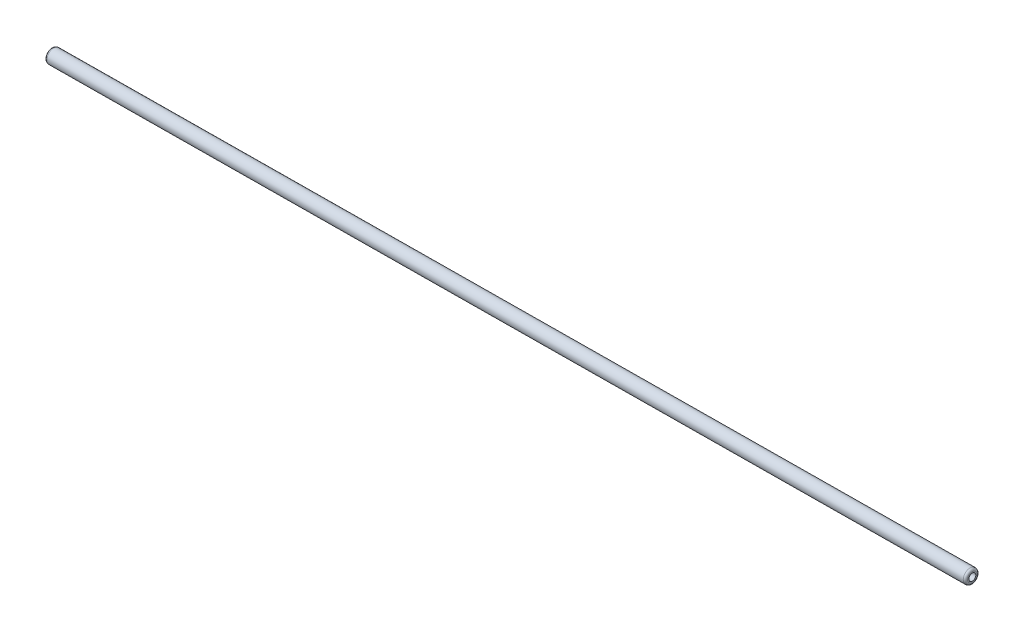
ISO-10303-21;
HEADER;
FILE_DESCRIPTION(('STEP AP214'),'2;1');
FILE_NAME('part.step','',(''),(''),'','','');
FILE_SCHEMA(('AUTOMOTIVE_DESIGN { 1 0 10303 214 1 1 1 1 }'));
ENDSEC;
DATA;
#1=APPLICATION_CONTEXT('core data for automotive mechanical design processes');
#2=APPLICATION_PROTOCOL_DEFINITION('international standard','automotive_design',2000,#1);
#3=PRODUCT_CONTEXT('',#1,'mechanical');
#4=PRODUCT('Part','Part','',(#3));
#5=PRODUCT_RELATED_PRODUCT_CATEGORY('part','',(#4));
#6=PRODUCT_DEFINITION_FORMATION('','',#4);
#7=PRODUCT_DEFINITION_CONTEXT('part definition',#1,'design');
#8=PRODUCT_DEFINITION('design','',#6,#7);
#9=PRODUCT_DEFINITION_SHAPE('','',#8);
#10=(LENGTH_UNIT() NAMED_UNIT(*) SI_UNIT(.MILLI.,.METRE.));
#11=(NAMED_UNIT(*) PLANE_ANGLE_UNIT() SI_UNIT($,.RADIAN.));
#12=(NAMED_UNIT(*) SI_UNIT($,.STERADIAN.) SOLID_ANGLE_UNIT());
#13=UNCERTAINTY_MEASURE_WITH_UNIT(LENGTH_MEASURE(1.E-05),#10,'distance_accuracy_value','');
#14=(GEOMETRIC_REPRESENTATION_CONTEXT(3) GLOBAL_UNCERTAINTY_ASSIGNED_CONTEXT((#13)) GLOBAL_UNIT_ASSIGNED_CONTEXT((#10,
#11,#12)) REPRESENTATION_CONTEXT('',''));
#15=CARTESIAN_POINT('',(0.,0.,0.));
#16=DIRECTION('',(0.,0.,1.));
#17=DIRECTION('',(1.,0.,0.));
#18=AXIS2_PLACEMENT_3D('',#15,#16,#17);
#19=CARTESIAN_POINT('',(-527.029931550962,-4.59932053544287,0.));
#20=DIRECTION('',(-0.999961923064154,-0.00872653550031851,0.));
#21=DIRECTION('',(0.,0.,1.));
#22=AXIS2_PLACEMENT_3D('',#19,#20,#21);
#23=PLANE('',#22);
#24=CARTESIAN_POINT('',(-527.029931550962,-4.59932053544287,0.));
#25=DIRECTION('',(-0.999961923064154,-0.00872653550031851,0.));
#26=DIRECTION('',(0.,0.,1.));
#27=AXIS2_PLACEMENT_3D('',#24,#25,#26);
#28=CIRCLE('',#27,5.4375);
#29=CARTESIAN_POINT('',(-527.029931550962,-4.59932053544287,5.4375));
#30=VERTEX_POINT('',#29);
#31=EDGE_CURVE('E10',#30,#30,#28,.T.);
#32=ORIENTED_EDGE('',*,*,#31,.T.);
#33=EDGE_LOOP('',(#32));
#34=FACE_BOUND('',#33,.T.);
#35=CARTESIAN_POINT('',(-527.029931550962,-4.59932053544287,0.));
#36=DIRECTION('',(-0.999961923064154,-0.00872653550031851,0.));
#37=DIRECTION('',(0.,0.,1.));
#38=AXIS2_PLACEMENT_3D('',#35,#36,#37);
#39=CIRCLE('',#38,3.975);
#40=CARTESIAN_POINT('',(-527.029931550962,-4.59932053544287,3.975));
#41=VERTEX_POINT('',#40);
#42=EDGE_CURVE('E66',#41,#41,#39,.T.);
#43=ORIENTED_EDGE('',*,*,#42,.F.);
#44=EDGE_LOOP('',(#43));
#45=FACE_BOUND('',#44,.T.);
#46=ADVANCED_FACE('F42',(#34,#45),#23,.T.);
#47=CARTESIAN_POINT('',(527.029931550962,4.59932053544287,0.));
#48=DIRECTION('',(-0.999961923064154,-0.00872653550031851,0.));
#49=DIRECTION('',(0.,0.,1.));
#50=AXIS2_PLACEMENT_3D('',#47,#48,#49);
#51=PLANE('',#50);
#52=CARTESIAN_POINT('',(527.029931550962,4.59932053544287,0.));
#53=DIRECTION('',(-0.999961923064154,-0.00872653550031851,0.));
#54=DIRECTION('',(0.,0.,1.));
#55=AXIS2_PLACEMENT_3D('',#52,#53,#54);
#56=CIRCLE('',#55,5.4375);
#57=CARTESIAN_POINT('',(527.029931550962,4.59932053544287,5.4375));
#58=VERTEX_POINT('',#57);
#59=EDGE_CURVE('E50',#58,#58,#56,.F.);
#60=ORIENTED_EDGE('',*,*,#59,.T.);
#61=EDGE_LOOP('',(#60));
#62=FACE_BOUND('',#61,.T.);
#63=CARTESIAN_POINT('',(527.029931550962,4.59932053544287,0.));
#64=DIRECTION('',(-0.999961923064154,-0.00872653550031851,0.));
#65=DIRECTION('',(0.,0.,1.));
#66=AXIS2_PLACEMENT_3D('',#63,#64,#65);
#67=CIRCLE('',#66,3.975);
#68=CARTESIAN_POINT('',(527.029931550962,4.59932053544287,3.975));
#69=VERTEX_POINT('',#68);
#70=EDGE_CURVE('E67',#69,#69,#67,.T.);
#71=ORIENTED_EDGE('',*,*,#70,.T.);
#72=EDGE_LOOP('',(#71));
#73=FACE_BOUND('',#72,.T.);
#74=ADVANCED_FACE('F79',(#62,#73),#51,.F.);
#75=CARTESIAN_POINT('',(-527.029931550962,-4.59932053544287,0.));
#76=DIRECTION('',(0.999961923064154,0.00872653550031851,0.));
#77=DIRECTION('',(0.,0.,-1.));
#78=AXIS2_PLACEMENT_3D('',#75,#76,#77);
#79=CYLINDRICAL_SURFACE('',#78,7.9375);
#80=CARTESIAN_POINT('',(524.530026743302,4.57750419669207,0.));
#81=DIRECTION('',(-0.999961923064154,-0.00872653550031851,0.));
#82=DIRECTION('',(0.,0.,1.));
#83=AXIS2_PLACEMENT_3D('',#80,#81,#82);
#84=CIRCLE('',#83,7.9375);
#85=CARTESIAN_POINT('',(524.530026743302,4.57750419669207,7.9375));
#86=VERTEX_POINT('',#85);
#87=EDGE_CURVE('E55',#86,#86,#84,.T.);
#88=ORIENTED_EDGE('',*,*,#87,.T.);
#89=EDGE_LOOP('',(#88));
#90=FACE_BOUND('',#89,.T.);
#91=CARTESIAN_POINT('',(-524.530026743302,-4.57750419669207,0.));
#92=DIRECTION('',(-0.999961923064154,-0.00872653550031851,0.));
#93=DIRECTION('',(0.,0.,1.));
#94=AXIS2_PLACEMENT_3D('',#91,#92,#93);
#95=CIRCLE('',#94,7.9375);
#96=CARTESIAN_POINT('',(-524.530026743302,-4.57750419669207,7.9375));
#97=VERTEX_POINT('',#96);
#98=EDGE_CURVE('E60',#97,#97,#95,.F.);
#99=ORIENTED_EDGE('',*,*,#98,.T.);
#100=EDGE_LOOP('',(#99));
#101=FACE_BOUND('',#100,.T.);
#102=ADVANCED_FACE('F84',(#90,#101),#79,.T.);
#103=CARTESIAN_POINT('',(-527.029931550962,-4.59932053544287,0.));
#104=DIRECTION('',(0.999961923064154,0.00872653550031851,0.));
#105=DIRECTION('',(0.,0.,-1.));
#106=AXIS2_PLACEMENT_3D('',#103,#104,#105);
#107=CYLINDRICAL_SURFACE('',#106,3.975);
#108=ORIENTED_EDGE('',*,*,#42,.T.);
#109=EDGE_LOOP('',(#108));
#110=FACE_BOUND('',#109,.T.);
#111=ORIENTED_EDGE('',*,*,#70,.F.);
#112=EDGE_LOOP('',(#111));
#113=FACE_BOUND('',#112,.T.);
#114=ADVANCED_FACE('F75',(#110,#113),#107,.F.);
#115=CARTESIAN_POINT('',(524.530026743302,4.57750419669207,0.));
#116=DIRECTION('',(-0.999961923064154,-0.00872653550031851,0.));
#117=DIRECTION('',(0.,0.,1.));
#118=AXIS2_PLACEMENT_3D('',#115,#116,#117);
#119=TOROIDAL_SURFACE('',#118,5.4375,2.5);
#120=ORIENTED_EDGE('',*,*,#59,.F.);
#121=EDGE_LOOP('',(#120));
#122=FACE_BOUND('',#121,.T.);
#123=ORIENTED_EDGE('',*,*,#87,.F.);
#124=EDGE_LOOP('',(#123));
#125=FACE_BOUND('',#124,.T.);
#126=ADVANCED_FACE('F90',(#122,#125),#119,.T.);
#127=CARTESIAN_POINT('',(-524.530026743302,-4.57750419669207,0.));
#128=DIRECTION('',(-0.999961923064154,-0.00872653550031851,0.));
#129=DIRECTION('',(0.,0.,1.));
#130=AXIS2_PLACEMENT_3D('',#127,#128,#129);
#131=TOROIDAL_SURFACE('',#130,5.4375,2.5);
#132=ORIENTED_EDGE('',*,*,#98,.F.);
#133=EDGE_LOOP('',(#132));
#134=FACE_BOUND('',#133,.T.);
#135=ORIENTED_EDGE('',*,*,#31,.F.);
#136=EDGE_LOOP('',(#135));
#137=FACE_BOUND('',#136,.T.);
#138=ADVANCED_FACE('F44',(#134,#137),#131,.T.);
#139=CLOSED_SHELL('',(#46,#74,#102,#114,#126,#138));
#140=MANIFOLD_SOLID_BREP('B2',#139);
#141=ADVANCED_BREP_SHAPE_REPRESENTATION('',(#18,#140),#14);
#142=SHAPE_DEFINITION_REPRESENTATION(#9,#141);
ENDSEC;
END-ISO-10303-21;
